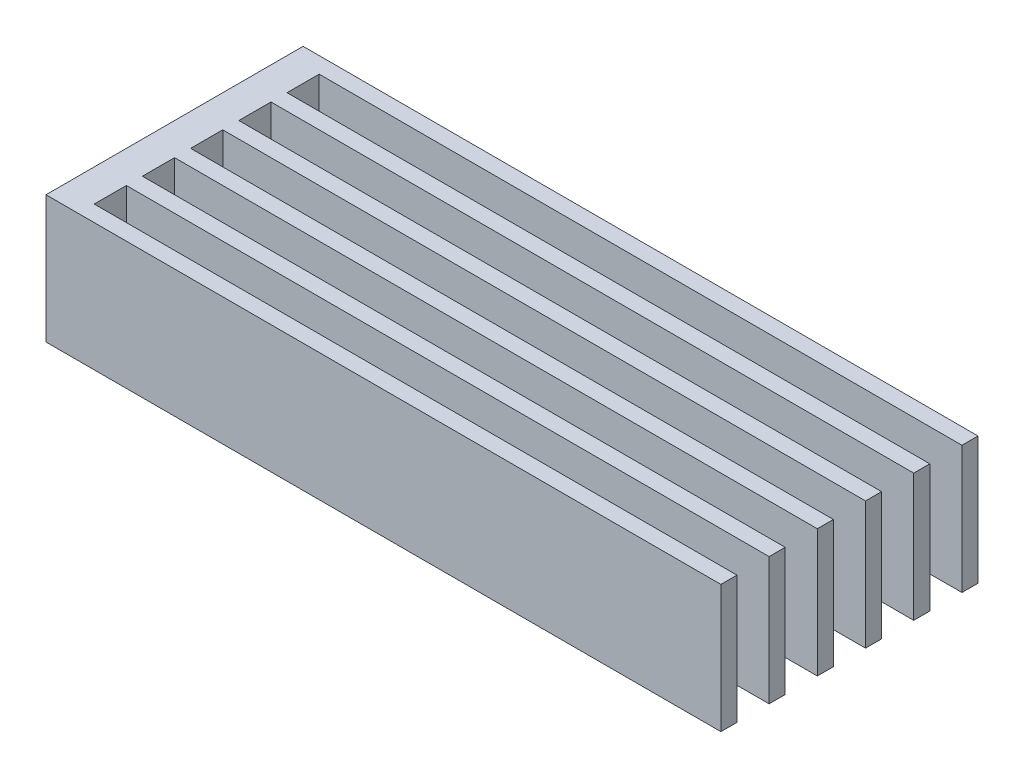
ISO-10303-21;
HEADER;
FILE_DESCRIPTION(('STEP AP214'),'2;1');
FILE_NAME('part.step','',(''),(''),'','','');
FILE_SCHEMA(('AUTOMOTIVE_DESIGN { 1 0 10303 214 1 1 1 1 }'));
ENDSEC;
DATA;
#1=APPLICATION_CONTEXT('core data for automotive mechanical design processes');
#2=APPLICATION_PROTOCOL_DEFINITION('international standard','automotive_design',2000,#1);
#3=PRODUCT_CONTEXT('',#1,'mechanical');
#4=PRODUCT('Part','Part','',(#3));
#5=PRODUCT_RELATED_PRODUCT_CATEGORY('part','',(#4));
#6=PRODUCT_DEFINITION_FORMATION('','',#4);
#7=PRODUCT_DEFINITION_CONTEXT('part definition',#1,'design');
#8=PRODUCT_DEFINITION('design','',#6,#7);
#9=PRODUCT_DEFINITION_SHAPE('','',#8);
#10=(LENGTH_UNIT() NAMED_UNIT(*) SI_UNIT(.MILLI.,.METRE.));
#11=(NAMED_UNIT(*) PLANE_ANGLE_UNIT() SI_UNIT($,.RADIAN.));
#12=(NAMED_UNIT(*) SI_UNIT($,.STERADIAN.) SOLID_ANGLE_UNIT());
#13=UNCERTAINTY_MEASURE_WITH_UNIT(LENGTH_MEASURE(1.E-05),#10,'distance_accuracy_value','');
#14=(GEOMETRIC_REPRESENTATION_CONTEXT(3) GLOBAL_UNCERTAINTY_ASSIGNED_CONTEXT((#13)) GLOBAL_UNIT_ASSIGNED_CONTEXT((#10,
#11,#12)) REPRESENTATION_CONTEXT('',''));
#15=CARTESIAN_POINT('',(0.,0.,0.));
#16=DIRECTION('',(0.,0.,1.));
#17=DIRECTION('',(1.,0.,0.));
#18=AXIS2_PLACEMENT_3D('',#15,#16,#17);
#19=CARTESIAN_POINT('',(-8.5810377543676,7.9375,0.));
#20=DIRECTION('',(1.,0.,0.));
#21=DIRECTION('',(0.,0.,-1.));
#22=AXIS2_PLACEMENT_3D('',#19,#20,#21);
#23=PLANE('',#22);
#24=DIRECTION('',(0.,-1.,0.));
#25=VECTOR('',#24,1.);
#26=CARTESIAN_POINT('',(-8.5810377543676,7.9375,-5.41379310344827));
#27=LINE('',#26,#25);
#28=CARTESIAN_POINT('',(-8.5810377543676,7.9375,-5.41379310344827));
#29=VERTEX_POINT('',#28);
#30=CARTESIAN_POINT('',(-8.5810377543676,0.,-5.41379310344827));
#31=VERTEX_POINT('',#30);
#32=EDGE_CURVE('E219',#29,#31,#27,.T.);
#33=ORIENTED_EDGE('',*,*,#32,.T.);
#34=DIRECTION('',(0.,0.,1.));
#35=VECTOR('',#34,1.);
#36=CARTESIAN_POINT('',(-8.5810377543676,0.,0.));
#37=LINE('',#36,#35);
#38=CARTESIAN_POINT('',(-8.5810377543676,0.,-7.41379310344827));
#39=VERTEX_POINT('',#38);
#40=EDGE_CURVE('E377',#39,#31,#37,.T.);
#41=ORIENTED_EDGE('',*,*,#40,.F.);
#42=DIRECTION('',(0.,-1.,0.));
#43=VECTOR('',#42,1.);
#44=CARTESIAN_POINT('',(-8.5810377543676,7.9375,-7.41379310344827));
#45=LINE('',#44,#43);
#46=CARTESIAN_POINT('',(-8.5810377543676,7.9375,-7.41379310344827));
#47=VERTEX_POINT('',#46);
#48=EDGE_CURVE('E257',#47,#39,#45,.T.);
#49=ORIENTED_EDGE('',*,*,#48,.F.);
#50=DIRECTION('',(0.,0.,1.));
#51=VECTOR('',#50,1.);
#52=CARTESIAN_POINT('',(-8.5810377543676,7.9375,0.));
#53=LINE('',#52,#51);
#54=EDGE_CURVE('E367',#47,#29,#53,.T.);
#55=ORIENTED_EDGE('',*,*,#54,.T.);
#56=EDGE_LOOP('',(#33,#41,#49,#55));
#57=FACE_BOUND('',#56,.T.);
#58=ADVANCED_FACE('F45',(#57),#23,.T.);
#59=DIRECTION('',(0.,-1.,0.));
#60=VECTOR('',#59,1.);
#61=CARTESIAN_POINT('',(-8.5810377543676,7.9375,-8.41379310344827));
#62=LINE('',#61,#60);
#63=CARTESIAN_POINT('',(-8.5810377543676,7.9375,-8.41379310344827));
#64=VERTEX_POINT('',#63);
#65=CARTESIAN_POINT('',(-8.5810377543676,0.,-8.41379310344827));
#66=VERTEX_POINT('',#65);
#67=EDGE_CURVE('E259',#64,#66,#62,.T.);
#68=ORIENTED_EDGE('',*,*,#67,.T.);
#69=CARTESIAN_POINT('',(-8.58103775436761,0.,-10.4137931034483));
#70=VERTEX_POINT('',#69);
#71=EDGE_CURVE('E419',#70,#66,#37,.T.);
#72=ORIENTED_EDGE('',*,*,#71,.F.);
#73=DIRECTION('',(0.,-1.,0.));
#74=VECTOR('',#73,1.);
#75=CARTESIAN_POINT('',(-8.5810377543676,7.9375,-10.4137931034483));
#76=LINE('',#75,#74);
#77=CARTESIAN_POINT('',(-8.5810377543676,7.9375,-10.4137931034483));
#78=VERTEX_POINT('',#77);
#79=EDGE_CURVE('E280',#78,#70,#76,.T.);
#80=ORIENTED_EDGE('',*,*,#79,.F.);
#81=EDGE_CURVE('E393',#78,#64,#53,.T.);
#82=ORIENTED_EDGE('',*,*,#81,.T.);
#83=EDGE_LOOP('',(#68,#72,#80,#82));
#84=FACE_BOUND('',#83,.T.);
#85=ADVANCED_FACE('F422',(#84),#23,.T.);
#86=DIRECTION('',(0.,-1.,0.));
#87=VECTOR('',#86,1.);
#88=CARTESIAN_POINT('',(-8.5810377543676,7.9375,-11.4137931034483));
#89=LINE('',#88,#87);
#90=CARTESIAN_POINT('',(-8.5810377543676,7.9375,-11.4137931034483));
#91=VERTEX_POINT('',#90);
#92=CARTESIAN_POINT('',(-8.5810377543676,0.,-11.4137931034483));
#93=VERTEX_POINT('',#92);
#94=EDGE_CURVE('E282',#91,#93,#89,.T.);
#95=ORIENTED_EDGE('',*,*,#94,.T.);
#96=CARTESIAN_POINT('',(-8.58103775436761,0.,-13.4137931034483));
#97=VERTEX_POINT('',#96);
#98=EDGE_CURVE('E417',#97,#93,#37,.T.);
#99=ORIENTED_EDGE('',*,*,#98,.F.);
#100=DIRECTION('',(0.,-1.,0.));
#101=VECTOR('',#100,1.);
#102=CARTESIAN_POINT('',(-8.58103775436761,7.9375,-13.4137931034483));
#103=LINE('',#102,#101);
#104=CARTESIAN_POINT('',(-8.58103775436761,7.9375,-13.4137931034483));
#105=VERTEX_POINT('',#104);
#106=EDGE_CURVE('E306',#105,#97,#103,.T.);
#107=ORIENTED_EDGE('',*,*,#106,.F.);
#108=EDGE_CURVE('E395',#105,#91,#53,.T.);
#109=ORIENTED_EDGE('',*,*,#108,.T.);
#110=EDGE_LOOP('',(#95,#99,#107,#109));
#111=FACE_BOUND('',#110,.T.);
#112=ADVANCED_FACE('F447',(#111),#23,.T.);
#113=DIRECTION('',(0.,-1.,0.));
#114=VECTOR('',#113,1.);
#115=CARTESIAN_POINT('',(-8.58103775436761,7.9375,-14.4137931034483));
#116=LINE('',#115,#114);
#117=CARTESIAN_POINT('',(-8.58103775436761,7.9375,-14.4137931034483));
#118=VERTEX_POINT('',#117);
#119=CARTESIAN_POINT('',(-8.58103775436761,0.,-14.4137931034483));
#120=VERTEX_POINT('',#119);
#121=EDGE_CURVE('E309',#118,#120,#116,.T.);
#122=ORIENTED_EDGE('',*,*,#121,.T.);
#123=CARTESIAN_POINT('',(-8.58103775436761,0.,-16.4137931034483));
#124=VERTEX_POINT('',#123);
#125=EDGE_CURVE('E379',#124,#120,#37,.T.);
#126=ORIENTED_EDGE('',*,*,#125,.F.);
#127=DIRECTION('',(0.,-1.,0.));
#128=VECTOR('',#127,1.);
#129=CARTESIAN_POINT('',(-8.58103775436761,7.9375,-16.4137931034483));
#130=LINE('',#129,#128);
#131=CARTESIAN_POINT('',(-8.58103775436761,7.9375,-16.4137931034483));
#132=VERTEX_POINT('',#131);
#133=EDGE_CURVE('E333',#132,#124,#130,.T.);
#134=ORIENTED_EDGE('',*,*,#133,.F.);
#135=EDGE_CURVE('E371',#132,#118,#53,.T.);
#136=ORIENTED_EDGE('',*,*,#135,.T.);
#137=EDGE_LOOP('',(#122,#126,#134,#136));
#138=FACE_BOUND('',#137,.T.);
#139=ADVANCED_FACE('F407',(#138),#23,.T.);
#140=CARTESIAN_POINT('',(0.,7.9375,-20.4137931034483));
#141=DIRECTION('',(0.,0.,-1.));
#142=DIRECTION('',(-1.,0.,0.));
#143=AXIS2_PLACEMENT_3D('',#140,#141,#142);
#144=PLANE('',#143);
#145=DIRECTION('',(1.,0.,0.));
#146=VECTOR('',#145,1.);
#147=CARTESIAN_POINT('',(0.,0.,-20.4137931034483));
#148=LINE('',#147,#146);
#149=CARTESIAN_POINT('',(-10.5810377543676,0.,-20.4137931034483));
#150=VERTEX_POINT('',#149);
#151=CARTESIAN_POINT('',(31.4189622456324,0.,-20.4137931034483));
#152=VERTEX_POINT('',#151);
#153=EDGE_CURVE('E360',#150,#152,#148,.T.);
#154=ORIENTED_EDGE('',*,*,#153,.F.);
#155=DIRECTION('',(0.,-1.,0.));
#156=VECTOR('',#155,1.);
#157=CARTESIAN_POINT('',(-10.5810377543676,7.9375,-20.4137931034483));
#158=LINE('',#157,#156);
#159=CARTESIAN_POINT('',(-10.5810377543676,7.9375,-20.4137931034483));
#160=VERTEX_POINT('',#159);
#161=EDGE_CURVE('E11',#160,#150,#158,.T.);
#162=ORIENTED_EDGE('',*,*,#161,.F.);
#163=DIRECTION('',(1.,0.,0.));
#164=VECTOR('',#163,1.);
#165=CARTESIAN_POINT('',(0.,7.9375,-20.4137931034483));
#166=LINE('',#165,#164);
#167=CARTESIAN_POINT('',(31.4189622456324,7.9375,-20.4137931034483));
#168=VERTEX_POINT('',#167);
#169=EDGE_CURVE('E361',#160,#168,#166,.T.);
#170=ORIENTED_EDGE('',*,*,#169,.T.);
#171=DIRECTION('',(0.,-1.,0.));
#172=VECTOR('',#171,1.);
#173=CARTESIAN_POINT('',(31.4189622456324,7.9375,-20.4137931034483));
#174=LINE('',#173,#172);
#175=EDGE_CURVE('E357',#168,#152,#174,.T.);
#176=ORIENTED_EDGE('',*,*,#175,.T.);
#177=EDGE_LOOP('',(#154,#162,#170,#176));
#178=FACE_BOUND('',#177,.T.);
#179=ADVANCED_FACE('F47',(#178),#144,.T.);
#180=CARTESIAN_POINT('',(-10.5810377543676,7.9375,0.));
#181=DIRECTION('',(1.,0.,0.));
#182=DIRECTION('',(0.,0.,-1.));
#183=AXIS2_PLACEMENT_3D('',#180,#181,#182);
#184=PLANE('',#183);
#185=DIRECTION('',(0.,0.,1.));
#186=VECTOR('',#185,1.);
#187=CARTESIAN_POINT('',(-10.5810377543676,0.,0.));
#188=LINE('',#187,#186);
#189=CARTESIAN_POINT('',(-10.5810377543676,0.,-4.41379310344827));
#190=VERTEX_POINT('',#189);
#191=EDGE_CURVE('E373',#150,#190,#188,.T.);
#192=ORIENTED_EDGE('',*,*,#191,.T.);
#193=DIRECTION('',(0.,-1.,0.));
#194=VECTOR('',#193,1.);
#195=CARTESIAN_POINT('',(-10.5810377543676,7.9375,-4.41379310344827));
#196=LINE('',#195,#194);
#197=CARTESIAN_POINT('',(-10.5810377543676,7.9375,-4.41379310344827));
#198=VERTEX_POINT('',#197);
#199=EDGE_CURVE('E53',#198,#190,#196,.T.);
#200=ORIENTED_EDGE('',*,*,#199,.F.);
#201=DIRECTION('',(0.,0.,1.));
#202=VECTOR('',#201,1.);
#203=CARTESIAN_POINT('',(-10.5810377543676,7.9375,0.));
#204=LINE('',#203,#202);
#205=EDGE_CURVE('E363',#160,#198,#204,.T.);
#206=ORIENTED_EDGE('',*,*,#205,.F.);
#207=ORIENTED_EDGE('',*,*,#161,.T.);
#208=EDGE_LOOP('',(#192,#200,#206,#207));
#209=FACE_BOUND('',#208,.T.);
#210=ADVANCED_FACE('F457',(#209),#184,.F.);
#211=CARTESIAN_POINT('',(0.,7.9375,-4.41379310344827));
#212=DIRECTION('',(0.,0.,-1.));
#213=DIRECTION('',(-1.,0.,0.));
#214=AXIS2_PLACEMENT_3D('',#211,#212,#213);
#215=PLANE('',#214);
#216=DIRECTION('',(1.,0.,0.));
#217=VECTOR('',#216,1.);
#218=CARTESIAN_POINT('',(0.,0.,-4.41379310344827));
#219=LINE('',#218,#217);
#220=CARTESIAN_POINT('',(31.4189622456324,0.,-4.41379310344827));
#221=VERTEX_POINT('',#220);
#222=EDGE_CURVE('E375',#190,#221,#219,.T.);
#223=ORIENTED_EDGE('',*,*,#222,.T.);
#224=DIRECTION('',(0.,-1.,0.));
#225=VECTOR('',#224,1.);
#226=CARTESIAN_POINT('',(31.4189622456324,7.9375,-4.41379310344827));
#227=LINE('',#226,#225);
#228=CARTESIAN_POINT('',(31.4189622456324,7.9375,-4.41379310344827));
#229=VERTEX_POINT('',#228);
#230=EDGE_CURVE('E235',#229,#221,#227,.T.);
#231=ORIENTED_EDGE('',*,*,#230,.F.);
#232=DIRECTION('',(1.,0.,0.));
#233=VECTOR('',#232,1.);
#234=CARTESIAN_POINT('',(0.,7.9375,-4.41379310344827));
#235=LINE('',#234,#233);
#236=EDGE_CURVE('E229',#198,#229,#235,.T.);
#237=ORIENTED_EDGE('',*,*,#236,.F.);
#238=ORIENTED_EDGE('',*,*,#199,.T.);
#239=EDGE_LOOP('',(#223,#231,#237,#238));
#240=FACE_BOUND('',#239,.T.);
#241=ADVANCED_FACE('F384',(#240),#215,.F.);
#242=DIRECTION('',(0.,-1.,0.));
#243=VECTOR('',#242,1.);
#244=CARTESIAN_POINT('',(-8.58103775436761,7.9375,-17.4137931034483));
#245=LINE('',#244,#243);
#246=CARTESIAN_POINT('',(-8.58103775436761,7.9375,-17.4137931034483));
#247=VERTEX_POINT('',#246);
#248=CARTESIAN_POINT('',(-8.58103775436761,0.,-17.4137931034483));
#249=VERTEX_POINT('',#248);
#250=EDGE_CURVE('E336',#247,#249,#245,.T.);
#251=ORIENTED_EDGE('',*,*,#250,.T.);
#252=CARTESIAN_POINT('',(-8.58103775436761,0.,-19.4137931034483));
#253=VERTEX_POINT('',#252);
#254=EDGE_CURVE('E364',#253,#249,#37,.T.);
#255=ORIENTED_EDGE('',*,*,#254,.F.);
#256=DIRECTION('',(0.,-1.,0.));
#257=VECTOR('',#256,1.);
#258=CARTESIAN_POINT('',(-8.58103775436761,7.9375,-19.4137931034483));
#259=LINE('',#258,#257);
#260=CARTESIAN_POINT('',(-8.58103775436761,7.9375,-19.4137931034483));
#261=VERTEX_POINT('',#260);
#262=EDGE_CURVE('E354',#261,#253,#259,.T.);
#263=ORIENTED_EDGE('',*,*,#262,.F.);
#264=EDGE_CURVE('E368',#261,#247,#53,.T.);
#265=ORIENTED_EDGE('',*,*,#264,.T.);
#266=EDGE_LOOP('',(#251,#255,#263,#265));
#267=FACE_BOUND('',#266,.T.);
#268=ADVANCED_FACE('F443',(#267),#23,.T.);
#269=CARTESIAN_POINT('',(0.,7.9375,0.));
#270=DIRECTION('',(0.,1.,0.));
#271=DIRECTION('',(0.,0.,1.));
#272=AXIS2_PLACEMENT_3D('',#269,#270,#271);
#273=PLANE('',#272);
#274=ORIENTED_EDGE('',*,*,#169,.F.);
#275=ORIENTED_EDGE('',*,*,#205,.T.);
#276=ORIENTED_EDGE('',*,*,#236,.T.);
#277=DIRECTION('',(0.,0.,1.));
#278=VECTOR('',#277,1.);
#279=CARTESIAN_POINT('',(31.4189622456324,7.9375,15.));
#280=LINE('',#279,#278);
#281=CARTESIAN_POINT('',(31.4189622456324,7.9375,-5.41379310344827));
#282=VERTEX_POINT('',#281);
#283=EDGE_CURVE('E212',#282,#229,#280,.T.);
#284=ORIENTED_EDGE('',*,*,#283,.F.);
#285=DIRECTION('',(1.,0.,0.));
#286=VECTOR('',#285,1.);
#287=CARTESIAN_POINT('',(0.,7.9375,-5.41379310344827));
#288=LINE('',#287,#286);
#289=EDGE_CURVE('E226',#29,#282,#288,.T.);
#290=ORIENTED_EDGE('',*,*,#289,.F.);
#291=ORIENTED_EDGE('',*,*,#54,.F.);
#292=DIRECTION('',(1.,0.,0.));
#293=VECTOR('',#292,1.);
#294=CARTESIAN_POINT('',(0.,7.9375,-7.41379310344827));
#295=LINE('',#294,#293);
#296=CARTESIAN_POINT('',(31.4189622456324,7.9375,-7.41379310344827));
#297=VERTEX_POINT('',#296);
#298=EDGE_CURVE('E248',#47,#297,#295,.T.);
#299=ORIENTED_EDGE('',*,*,#298,.T.);
#300=DIRECTION('',(0.,0.,1.));
#301=VECTOR('',#300,1.);
#302=CARTESIAN_POINT('',(31.4189622456324,7.9375,12.));
#303=LINE('',#302,#301);
#304=CARTESIAN_POINT('',(31.4189622456324,7.9375,-8.41379310344827));
#305=VERTEX_POINT('',#304);
#306=EDGE_CURVE('E242',#305,#297,#303,.T.);
#307=ORIENTED_EDGE('',*,*,#306,.F.);
#308=DIRECTION('',(1.,0.,0.));
#309=VECTOR('',#308,1.);
#310=CARTESIAN_POINT('',(0.,7.9375,-8.41379310344827));
#311=LINE('',#310,#309);
#312=EDGE_CURVE('E245',#64,#305,#311,.T.);
#313=ORIENTED_EDGE('',*,*,#312,.F.);
#314=ORIENTED_EDGE('',*,*,#81,.F.);
#315=DIRECTION('',(1.,0.,0.));
#316=VECTOR('',#315,1.);
#317=CARTESIAN_POINT('',(0.,7.9375,-10.4137931034483));
#318=LINE('',#317,#316);
#319=CARTESIAN_POINT('',(31.4189622456324,7.9375,-10.4137931034483));
#320=VERTEX_POINT('',#319);
#321=EDGE_CURVE('E271',#78,#320,#318,.T.);
#322=ORIENTED_EDGE('',*,*,#321,.T.);
#323=DIRECTION('',(0.,0.,1.));
#324=VECTOR('',#323,1.);
#325=CARTESIAN_POINT('',(31.4189622456324,7.9375,9.));
#326=LINE('',#325,#324);
#327=CARTESIAN_POINT('',(31.4189622456324,7.9375,-11.4137931034483));
#328=VERTEX_POINT('',#327);
#329=EDGE_CURVE('E265',#328,#320,#326,.T.);
#330=ORIENTED_EDGE('',*,*,#329,.F.);
#331=DIRECTION('',(1.,0.,0.));
#332=VECTOR('',#331,1.);
#333=CARTESIAN_POINT('',(0.,7.9375,-11.4137931034483));
#334=LINE('',#333,#332);
#335=EDGE_CURVE('E268',#91,#328,#334,.T.);
#336=ORIENTED_EDGE('',*,*,#335,.F.);
#337=ORIENTED_EDGE('',*,*,#108,.F.);
#338=DIRECTION('',(1.,0.,0.));
#339=VECTOR('',#338,1.);
#340=CARTESIAN_POINT('',(0.,7.9375,-13.4137931034483));
#341=LINE('',#340,#339);
#342=CARTESIAN_POINT('',(31.4189622456324,7.9375,-13.4137931034483));
#343=VERTEX_POINT('',#342);
#344=EDGE_CURVE('E295',#105,#343,#341,.T.);
#345=ORIENTED_EDGE('',*,*,#344,.T.);
#346=DIRECTION('',(0.,0.,1.));
#347=VECTOR('',#346,1.);
#348=CARTESIAN_POINT('',(31.4189622456324,7.9375,6.));
#349=LINE('',#348,#347);
#350=CARTESIAN_POINT('',(31.4189622456324,7.9375,-14.4137931034483));
#351=VERTEX_POINT('',#350);
#352=EDGE_CURVE('E288',#351,#343,#349,.T.);
#353=ORIENTED_EDGE('',*,*,#352,.F.);
#354=DIRECTION('',(1.,0.,0.));
#355=VECTOR('',#354,1.);
#356=CARTESIAN_POINT('',(0.,7.9375,-14.4137931034483));
#357=LINE('',#356,#355);
#358=EDGE_CURVE('E291',#118,#351,#357,.T.);
#359=ORIENTED_EDGE('',*,*,#358,.F.);
#360=ORIENTED_EDGE('',*,*,#135,.F.);
#361=DIRECTION('',(1.,0.,0.));
#362=VECTOR('',#361,1.);
#363=CARTESIAN_POINT('',(0.,7.9375,-16.4137931034483));
#364=LINE('',#363,#362);
#365=CARTESIAN_POINT('',(31.4189622456324,7.9375,-16.4137931034483));
#366=VERTEX_POINT('',#365);
#367=EDGE_CURVE('E322',#132,#366,#364,.T.);
#368=ORIENTED_EDGE('',*,*,#367,.T.);
#369=DIRECTION('',(0.,0.,1.));
#370=VECTOR('',#369,1.);
#371=CARTESIAN_POINT('',(31.4189622456324,7.9375,3.));
#372=LINE('',#371,#370);
#373=CARTESIAN_POINT('',(31.4189622456324,7.9375,-17.4137931034483));
#374=VERTEX_POINT('',#373);
#375=EDGE_CURVE('E315',#374,#366,#372,.T.);
#376=ORIENTED_EDGE('',*,*,#375,.F.);
#377=DIRECTION('',(1.,0.,0.));
#378=VECTOR('',#377,1.);
#379=CARTESIAN_POINT('',(0.,7.9375,-17.4137931034483));
#380=LINE('',#379,#378);
#381=EDGE_CURVE('E318',#247,#374,#380,.T.);
#382=ORIENTED_EDGE('',*,*,#381,.F.);
#383=ORIENTED_EDGE('',*,*,#264,.F.);
#384=DIRECTION('',(1.,0.,0.));
#385=VECTOR('',#384,1.);
#386=CARTESIAN_POINT('',(0.,7.9375,-19.4137931034483));
#387=LINE('',#386,#385);
#388=CARTESIAN_POINT('',(31.4189622456324,7.9375,-19.4137931034483));
#389=VERTEX_POINT('',#388);
#390=EDGE_CURVE('E345',#261,#389,#387,.T.);
#391=ORIENTED_EDGE('',*,*,#390,.T.);
#392=DIRECTION('',(0.,0.,1.));
#393=VECTOR('',#392,1.);
#394=CARTESIAN_POINT('',(31.4189622456324,7.9375,0.));
#395=LINE('',#394,#393);
#396=EDGE_CURVE('E342',#168,#389,#395,.T.);
#397=ORIENTED_EDGE('',*,*,#396,.F.);
#398=EDGE_LOOP('',(#274,#275,#276,#284,#290,#291,#299,#307,#313,#314,#322,#330,#336,#337,#345,
#353,#359,#360,#368,#376,#382,#383,#391,#397));
#399=FACE_BOUND('',#398,.T.);
#400=ADVANCED_FACE('F224',(#399),#273,.T.);
#401=CARTESIAN_POINT('',(0.,0.,0.));
#402=DIRECTION('',(0.,1.,0.));
#403=DIRECTION('',(0.,0.,1.));
#404=AXIS2_PLACEMENT_3D('',#401,#402,#403);
#405=PLANE('',#404);
#406=ORIENTED_EDGE('',*,*,#153,.T.);
#407=DIRECTION('',(0.,0.,1.));
#408=VECTOR('',#407,1.);
#409=CARTESIAN_POINT('',(31.4189622456324,0.,0.));
#410=LINE('',#409,#408);
#411=CARTESIAN_POINT('',(31.4189622456324,0.,-19.4137931034483));
#412=VERTEX_POINT('',#411);
#413=EDGE_CURVE('E341',#152,#412,#410,.T.);
#414=ORIENTED_EDGE('',*,*,#413,.T.);
#415=DIRECTION('',(1.,0.,0.));
#416=VECTOR('',#415,1.);
#417=CARTESIAN_POINT('',(0.,0.,-19.4137931034483));
#418=LINE('',#417,#416);
#419=EDGE_CURVE('E346',#253,#412,#418,.T.);
#420=ORIENTED_EDGE('',*,*,#419,.F.);
#421=ORIENTED_EDGE('',*,*,#254,.T.);
#422=DIRECTION('',(1.,0.,0.));
#423=VECTOR('',#422,1.);
#424=CARTESIAN_POINT('',(0.,0.,-17.4137931034483));
#425=LINE('',#424,#423);
#426=CARTESIAN_POINT('',(31.4189622456324,0.,-17.4137931034483));
#427=VERTEX_POINT('',#426);
#428=EDGE_CURVE('E327',#249,#427,#425,.T.);
#429=ORIENTED_EDGE('',*,*,#428,.T.);
#430=DIRECTION('',(0.,0.,1.));
#431=VECTOR('',#430,1.);
#432=CARTESIAN_POINT('',(31.4189622456324,0.,3.));
#433=LINE('',#432,#431);
#434=CARTESIAN_POINT('',(31.4189622456324,0.,-16.4137931034483));
#435=VERTEX_POINT('',#434);
#436=EDGE_CURVE('E314',#427,#435,#433,.T.);
#437=ORIENTED_EDGE('',*,*,#436,.T.);
#438=DIRECTION('',(1.,0.,0.));
#439=VECTOR('',#438,1.);
#440=CARTESIAN_POINT('',(0.,0.,-16.4137931034483));
#441=LINE('',#440,#439);
#442=EDGE_CURVE('E319',#124,#435,#441,.T.);
#443=ORIENTED_EDGE('',*,*,#442,.F.);
#444=ORIENTED_EDGE('',*,*,#125,.T.);
#445=DIRECTION('',(1.,0.,0.));
#446=VECTOR('',#445,1.);
#447=CARTESIAN_POINT('',(0.,0.,-14.4137931034483));
#448=LINE('',#447,#446);
#449=CARTESIAN_POINT('',(31.4189622456324,0.,-14.4137931034483));
#450=VERTEX_POINT('',#449);
#451=EDGE_CURVE('E300',#120,#450,#448,.T.);
#452=ORIENTED_EDGE('',*,*,#451,.T.);
#453=DIRECTION('',(0.,0.,1.));
#454=VECTOR('',#453,1.);
#455=CARTESIAN_POINT('',(31.4189622456324,0.,6.));
#456=LINE('',#455,#454);
#457=CARTESIAN_POINT('',(31.4189622456324,0.,-13.4137931034483));
#458=VERTEX_POINT('',#457);
#459=EDGE_CURVE('E287',#450,#458,#456,.T.);
#460=ORIENTED_EDGE('',*,*,#459,.T.);
#461=DIRECTION('',(1.,0.,0.));
#462=VECTOR('',#461,1.);
#463=CARTESIAN_POINT('',(0.,0.,-13.4137931034483));
#464=LINE('',#463,#462);
#465=EDGE_CURVE('E292',#97,#458,#464,.T.);
#466=ORIENTED_EDGE('',*,*,#465,.F.);
#467=ORIENTED_EDGE('',*,*,#98,.T.);
#468=DIRECTION('',(1.,0.,0.));
#469=VECTOR('',#468,1.);
#470=CARTESIAN_POINT('',(0.,0.,-11.4137931034483));
#471=LINE('',#470,#469);
#472=CARTESIAN_POINT('',(31.4189622456324,0.,-11.4137931034483));
#473=VERTEX_POINT('',#472);
#474=EDGE_CURVE('E275',#93,#473,#471,.T.);
#475=ORIENTED_EDGE('',*,*,#474,.T.);
#476=DIRECTION('',(0.,0.,1.));
#477=VECTOR('',#476,1.);
#478=CARTESIAN_POINT('',(31.4189622456324,0.,9.));
#479=LINE('',#478,#477);
#480=CARTESIAN_POINT('',(31.4189622456324,0.,-10.4137931034483));
#481=VERTEX_POINT('',#480);
#482=EDGE_CURVE('E264',#473,#481,#479,.T.);
#483=ORIENTED_EDGE('',*,*,#482,.T.);
#484=DIRECTION('',(1.,0.,0.));
#485=VECTOR('',#484,1.);
#486=CARTESIAN_POINT('',(0.,0.,-10.4137931034483));
#487=LINE('',#486,#485);
#488=EDGE_CURVE('E67',#70,#481,#487,.T.);
#489=ORIENTED_EDGE('',*,*,#488,.F.);
#490=ORIENTED_EDGE('',*,*,#71,.T.);
#491=DIRECTION('',(1.,0.,0.));
#492=VECTOR('',#491,1.);
#493=CARTESIAN_POINT('',(0.,0.,-8.41379310344827));
#494=LINE('',#493,#492);
#495=CARTESIAN_POINT('',(31.4189622456324,0.,-8.41379310344827));
#496=VERTEX_POINT('',#495);
#497=EDGE_CURVE('E252',#66,#496,#494,.T.);
#498=ORIENTED_EDGE('',*,*,#497,.T.);
#499=DIRECTION('',(0.,0.,1.));
#500=VECTOR('',#499,1.);
#501=CARTESIAN_POINT('',(31.4189622456324,0.,12.));
#502=LINE('',#501,#500);
#503=CARTESIAN_POINT('',(31.4189622456324,0.,-7.41379310344827));
#504=VERTEX_POINT('',#503);
#505=EDGE_CURVE('E218',#496,#504,#502,.T.);
#506=ORIENTED_EDGE('',*,*,#505,.T.);
#507=DIRECTION('',(1.,0.,0.));
#508=VECTOR('',#507,1.);
#509=CARTESIAN_POINT('',(0.,0.,-7.41379310344827));
#510=LINE('',#509,#508);
#511=EDGE_CURVE('E60',#39,#504,#510,.T.);
#512=ORIENTED_EDGE('',*,*,#511,.F.);
#513=ORIENTED_EDGE('',*,*,#40,.T.);
#514=DIRECTION('',(1.,0.,0.));
#515=VECTOR('',#514,1.);
#516=CARTESIAN_POINT('',(0.,0.,-5.41379310344827));
#517=LINE('',#516,#515);
#518=CARTESIAN_POINT('',(31.4189622456324,0.,-5.41379310344827));
#519=VERTEX_POINT('',#518);
#520=EDGE_CURVE('E231',#31,#519,#517,.T.);
#521=ORIENTED_EDGE('',*,*,#520,.T.);
#522=DIRECTION('',(0.,0.,1.));
#523=VECTOR('',#522,1.);
#524=CARTESIAN_POINT('',(31.4189622456324,0.,15.));
#525=LINE('',#524,#523);
#526=EDGE_CURVE('E214',#519,#221,#525,.T.);
#527=ORIENTED_EDGE('',*,*,#526,.T.);
#528=ORIENTED_EDGE('',*,*,#222,.F.);
#529=ORIENTED_EDGE('',*,*,#191,.F.);
#530=EDGE_LOOP('',(#406,#414,#420,#421,#429,#437,#443,#444,#452,#460,#466,#467,#475,#483,#489,
#490,#498,#506,#512,#513,#521,#527,#528,#529));
#531=FACE_BOUND('',#530,.T.);
#532=ADVANCED_FACE('F388',(#531),#405,.F.);
#533=CARTESIAN_POINT('',(31.4189622456324,7.9375,0.));
#534=DIRECTION('',(1.,0.,0.));
#535=DIRECTION('',(0.,0.,-1.));
#536=AXIS2_PLACEMENT_3D('',#533,#534,#535);
#537=PLANE('',#536);
#538=ORIENTED_EDGE('',*,*,#413,.F.);
#539=ORIENTED_EDGE('',*,*,#175,.F.);
#540=ORIENTED_EDGE('',*,*,#396,.T.);
#541=DIRECTION('',(0.,-1.,0.));
#542=VECTOR('',#541,1.);
#543=CARTESIAN_POINT('',(31.4189622456324,7.9375,-19.4137931034483));
#544=LINE('',#543,#542);
#545=EDGE_CURVE('E348',#389,#412,#544,.T.);
#546=ORIENTED_EDGE('',*,*,#545,.T.);
#547=EDGE_LOOP('',(#538,#539,#540,#546));
#548=FACE_BOUND('',#547,.T.);
#549=ADVANCED_FACE('F512',(#548),#537,.T.);
#550=CARTESIAN_POINT('',(0.,7.9375,-19.4137931034483));
#551=DIRECTION('',(0.,0.,-1.));
#552=DIRECTION('',(-1.,0.,0.));
#553=AXIS2_PLACEMENT_3D('',#550,#551,#552);
#554=PLANE('',#553);
#555=ORIENTED_EDGE('',*,*,#419,.T.);
#556=ORIENTED_EDGE('',*,*,#545,.F.);
#557=ORIENTED_EDGE('',*,*,#390,.F.);
#558=ORIENTED_EDGE('',*,*,#262,.T.);
#559=EDGE_LOOP('',(#555,#556,#557,#558));
#560=FACE_BOUND('',#559,.T.);
#561=ADVANCED_FACE('F508',(#560),#554,.F.);
#562=CARTESIAN_POINT('',(31.4189622456324,7.9375,3.));
#563=DIRECTION('',(1.,0.,0.));
#564=DIRECTION('',(0.,0.,-1.));
#565=AXIS2_PLACEMENT_3D('',#562,#563,#564);
#566=PLANE('',#565);
#567=ORIENTED_EDGE('',*,*,#436,.F.);
#568=DIRECTION('',(0.,-1.,0.));
#569=VECTOR('',#568,1.);
#570=CARTESIAN_POINT('',(31.4189622456324,7.9375,-17.4137931034483));
#571=LINE('',#570,#569);
#572=EDGE_CURVE('E339',#374,#427,#571,.T.);
#573=ORIENTED_EDGE('',*,*,#572,.F.);
#574=ORIENTED_EDGE('',*,*,#375,.T.);
#575=DIRECTION('',(0.,-1.,0.));
#576=VECTOR('',#575,1.);
#577=CARTESIAN_POINT('',(31.4189622456324,7.9375,-16.4137931034483));
#578=LINE('',#577,#576);
#579=EDGE_CURVE('E324',#366,#435,#578,.T.);
#580=ORIENTED_EDGE('',*,*,#579,.T.);
#581=EDGE_LOOP('',(#567,#573,#574,#580));
#582=FACE_BOUND('',#581,.T.);
#583=ADVANCED_FACE('F504',(#582),#566,.T.);
#584=CARTESIAN_POINT('',(0.,7.9375,-17.4137931034483));
#585=DIRECTION('',(0.,0.,-1.));
#586=DIRECTION('',(-1.,0.,0.));
#587=AXIS2_PLACEMENT_3D('',#584,#585,#586);
#588=PLANE('',#587);
#589=ORIENTED_EDGE('',*,*,#428,.F.);
#590=ORIENTED_EDGE('',*,*,#250,.F.);
#591=ORIENTED_EDGE('',*,*,#381,.T.);
#592=ORIENTED_EDGE('',*,*,#572,.T.);
#593=EDGE_LOOP('',(#589,#590,#591,#592));
#594=FACE_BOUND('',#593,.T.);
#595=ADVANCED_FACE('F500',(#594),#588,.T.);
#596=CARTESIAN_POINT('',(0.,7.9375,-16.4137931034483));
#597=DIRECTION('',(0.,0.,-1.));
#598=DIRECTION('',(-1.,0.,0.));
#599=AXIS2_PLACEMENT_3D('',#596,#597,#598);
#600=PLANE('',#599);
#601=ORIENTED_EDGE('',*,*,#442,.T.);
#602=ORIENTED_EDGE('',*,*,#579,.F.);
#603=ORIENTED_EDGE('',*,*,#367,.F.);
#604=ORIENTED_EDGE('',*,*,#133,.T.);
#605=EDGE_LOOP('',(#601,#602,#603,#604));
#606=FACE_BOUND('',#605,.T.);
#607=ADVANCED_FACE('F496',(#606),#600,.F.);
#608=CARTESIAN_POINT('',(31.4189622456324,7.9375,6.));
#609=DIRECTION('',(1.,0.,0.));
#610=DIRECTION('',(0.,0.,-1.));
#611=AXIS2_PLACEMENT_3D('',#608,#609,#610);
#612=PLANE('',#611);
#613=ORIENTED_EDGE('',*,*,#459,.F.);
#614=DIRECTION('',(0.,-1.,0.));
#615=VECTOR('',#614,1.);
#616=CARTESIAN_POINT('',(31.4189622456324,7.9375,-14.4137931034483));
#617=LINE('',#616,#615);
#618=EDGE_CURVE('E312',#351,#450,#617,.T.);
#619=ORIENTED_EDGE('',*,*,#618,.F.);
#620=ORIENTED_EDGE('',*,*,#352,.T.);
#621=DIRECTION('',(0.,-1.,0.));
#622=VECTOR('',#621,1.);
#623=CARTESIAN_POINT('',(31.4189622456324,7.9375,-13.4137931034483));
#624=LINE('',#623,#622);
#625=EDGE_CURVE('E297',#343,#458,#624,.T.);
#626=ORIENTED_EDGE('',*,*,#625,.T.);
#627=EDGE_LOOP('',(#613,#619,#620,#626));
#628=FACE_BOUND('',#627,.T.);
#629=ADVANCED_FACE('F493',(#628),#612,.T.);
#630=CARTESIAN_POINT('',(0.,7.9375,-14.4137931034483));
#631=DIRECTION('',(0.,0.,-1.));
#632=DIRECTION('',(-1.,0.,0.));
#633=AXIS2_PLACEMENT_3D('',#630,#631,#632);
#634=PLANE('',#633);
#635=ORIENTED_EDGE('',*,*,#451,.F.);
#636=ORIENTED_EDGE('',*,*,#121,.F.);
#637=ORIENTED_EDGE('',*,*,#358,.T.);
#638=ORIENTED_EDGE('',*,*,#618,.T.);
#639=EDGE_LOOP('',(#635,#636,#637,#638));
#640=FACE_BOUND('',#639,.T.);
#641=ADVANCED_FACE('F415',(#640),#634,.T.);
#642=CARTESIAN_POINT('',(0.,7.9375,-13.4137931034483));
#643=DIRECTION('',(0.,0.,-1.));
#644=DIRECTION('',(-1.,0.,0.));
#645=AXIS2_PLACEMENT_3D('',#642,#643,#644);
#646=PLANE('',#645);
#647=ORIENTED_EDGE('',*,*,#465,.T.);
#648=ORIENTED_EDGE('',*,*,#625,.F.);
#649=ORIENTED_EDGE('',*,*,#344,.F.);
#650=ORIENTED_EDGE('',*,*,#106,.T.);
#651=EDGE_LOOP('',(#647,#648,#649,#650));
#652=FACE_BOUND('',#651,.T.);
#653=ADVANCED_FACE('F487',(#652),#646,.F.);
#654=CARTESIAN_POINT('',(31.4189622456324,7.9375,9.));
#655=DIRECTION('',(1.,0.,0.));
#656=DIRECTION('',(0.,0.,-1.));
#657=AXIS2_PLACEMENT_3D('',#654,#655,#656);
#658=PLANE('',#657);
#659=ORIENTED_EDGE('',*,*,#482,.F.);
#660=DIRECTION('',(0.,-1.,0.));
#661=VECTOR('',#660,1.);
#662=CARTESIAN_POINT('',(31.4189622456324,7.9375,-11.4137931034483));
#663=LINE('',#662,#661);
#664=EDGE_CURVE('E285',#328,#473,#663,.T.);
#665=ORIENTED_EDGE('',*,*,#664,.F.);
#666=ORIENTED_EDGE('',*,*,#329,.T.);
#667=DIRECTION('',(0.,-1.,0.));
#668=VECTOR('',#667,1.);
#669=CARTESIAN_POINT('',(31.4189622456324,7.9375,-10.4137931034483));
#670=LINE('',#669,#668);
#671=EDGE_CURVE('E273',#320,#481,#670,.T.);
#672=ORIENTED_EDGE('',*,*,#671,.T.);
#673=EDGE_LOOP('',(#659,#665,#666,#672));
#674=FACE_BOUND('',#673,.T.);
#675=ADVANCED_FACE('F473',(#674),#658,.T.);
#676=CARTESIAN_POINT('',(0.,7.9375,-11.4137931034483));
#677=DIRECTION('',(0.,0.,-1.));
#678=DIRECTION('',(-1.,0.,0.));
#679=AXIS2_PLACEMENT_3D('',#676,#677,#678);
#680=PLANE('',#679);
#681=ORIENTED_EDGE('',*,*,#474,.F.);
#682=ORIENTED_EDGE('',*,*,#94,.F.);
#683=ORIENTED_EDGE('',*,*,#335,.T.);
#684=ORIENTED_EDGE('',*,*,#664,.T.);
#685=EDGE_LOOP('',(#681,#682,#683,#684));
#686=FACE_BOUND('',#685,.T.);
#687=ADVANCED_FACE('F468',(#686),#680,.T.);
#688=CARTESIAN_POINT('',(0.,7.9375,-10.4137931034483));
#689=DIRECTION('',(0.,0.,-1.));
#690=DIRECTION('',(-1.,0.,0.));
#691=AXIS2_PLACEMENT_3D('',#688,#689,#690);
#692=PLANE('',#691);
#693=ORIENTED_EDGE('',*,*,#488,.T.);
#694=ORIENTED_EDGE('',*,*,#671,.F.);
#695=ORIENTED_EDGE('',*,*,#321,.F.);
#696=ORIENTED_EDGE('',*,*,#79,.T.);
#697=EDGE_LOOP('',(#693,#694,#695,#696));
#698=FACE_BOUND('',#697,.T.);
#699=ADVANCED_FACE('F475',(#698),#692,.F.);
#700=CARTESIAN_POINT('',(31.4189622456324,7.9375,12.));
#701=DIRECTION('',(1.,0.,0.));
#702=DIRECTION('',(0.,0.,-1.));
#703=AXIS2_PLACEMENT_3D('',#700,#701,#702);
#704=PLANE('',#703);
#705=ORIENTED_EDGE('',*,*,#505,.F.);
#706=DIRECTION('',(0.,-1.,0.));
#707=VECTOR('',#706,1.);
#708=CARTESIAN_POINT('',(31.4189622456324,7.9375,-8.41379310344827));
#709=LINE('',#708,#707);
#710=EDGE_CURVE('E262',#305,#496,#709,.T.);
#711=ORIENTED_EDGE('',*,*,#710,.F.);
#712=ORIENTED_EDGE('',*,*,#306,.T.);
#713=DIRECTION('',(0.,-1.,0.));
#714=VECTOR('',#713,1.);
#715=CARTESIAN_POINT('',(31.4189622456324,7.9375,-7.41379310344827));
#716=LINE('',#715,#714);
#717=EDGE_CURVE('E250',#297,#504,#716,.T.);
#718=ORIENTED_EDGE('',*,*,#717,.T.);
#719=EDGE_LOOP('',(#705,#711,#712,#718));
#720=FACE_BOUND('',#719,.T.);
#721=ADVANCED_FACE('F430',(#720),#704,.T.);
#722=CARTESIAN_POINT('',(0.,7.9375,-8.41379310344827));
#723=DIRECTION('',(0.,0.,-1.));
#724=DIRECTION('',(-1.,0.,0.));
#725=AXIS2_PLACEMENT_3D('',#722,#723,#724);
#726=PLANE('',#725);
#727=ORIENTED_EDGE('',*,*,#497,.F.);
#728=ORIENTED_EDGE('',*,*,#67,.F.);
#729=ORIENTED_EDGE('',*,*,#312,.T.);
#730=ORIENTED_EDGE('',*,*,#710,.T.);
#731=EDGE_LOOP('',(#727,#728,#729,#730));
#732=FACE_BOUND('',#731,.T.);
#733=ADVANCED_FACE('F425',(#732),#726,.T.);
#734=CARTESIAN_POINT('',(0.,7.9375,-7.41379310344827));
#735=DIRECTION('',(0.,0.,-1.));
#736=DIRECTION('',(-1.,0.,0.));
#737=AXIS2_PLACEMENT_3D('',#734,#735,#736);
#738=PLANE('',#737);
#739=ORIENTED_EDGE('',*,*,#511,.T.);
#740=ORIENTED_EDGE('',*,*,#717,.F.);
#741=ORIENTED_EDGE('',*,*,#298,.F.);
#742=ORIENTED_EDGE('',*,*,#48,.T.);
#743=EDGE_LOOP('',(#739,#740,#741,#742));
#744=FACE_BOUND('',#743,.T.);
#745=ADVANCED_FACE('F432',(#744),#738,.F.);
#746=CARTESIAN_POINT('',(31.4189622456324,7.9375,15.));
#747=DIRECTION('',(1.,0.,0.));
#748=DIRECTION('',(0.,0.,-1.));
#749=AXIS2_PLACEMENT_3D('',#746,#747,#748);
#750=PLANE('',#749);
#751=ORIENTED_EDGE('',*,*,#526,.F.);
#752=DIRECTION('',(0.,-1.,0.));
#753=VECTOR('',#752,1.);
#754=CARTESIAN_POINT('',(31.4189622456324,7.9375,-5.41379310344827));
#755=LINE('',#754,#753);
#756=EDGE_CURVE('E208',#282,#519,#755,.T.);
#757=ORIENTED_EDGE('',*,*,#756,.F.);
#758=ORIENTED_EDGE('',*,*,#283,.T.);
#759=ORIENTED_EDGE('',*,*,#230,.T.);
#760=EDGE_LOOP('',(#751,#757,#758,#759));
#761=FACE_BOUND('',#760,.T.);
#762=ADVANCED_FACE('F210',(#761),#750,.T.);
#763=CARTESIAN_POINT('',(0.,7.9375,-5.41379310344827));
#764=DIRECTION('',(0.,0.,-1.));
#765=DIRECTION('',(-1.,0.,0.));
#766=AXIS2_PLACEMENT_3D('',#763,#764,#765);
#767=PLANE('',#766);
#768=ORIENTED_EDGE('',*,*,#520,.F.);
#769=ORIENTED_EDGE('',*,*,#32,.F.);
#770=ORIENTED_EDGE('',*,*,#289,.T.);
#771=ORIENTED_EDGE('',*,*,#756,.T.);
#772=EDGE_LOOP('',(#768,#769,#770,#771));
#773=FACE_BOUND('',#772,.T.);
#774=ADVANCED_FACE('F233',(#773),#767,.T.);
#775=CLOSED_SHELL('',(#58,#85,#112,#139,#179,#210,#241,#268,#400,#532,#549,#561,#583,#595,#607,
#629,#641,#653,#675,#687,#699,#721,#733,#745,#762,#774));
#776=MANIFOLD_SOLID_BREP('B2',#775);
#777=ADVANCED_BREP_SHAPE_REPRESENTATION('',(#18,#776),#14);
#778=SHAPE_DEFINITION_REPRESENTATION(#9,#777);
ENDSEC;
END-ISO-10303-21;
